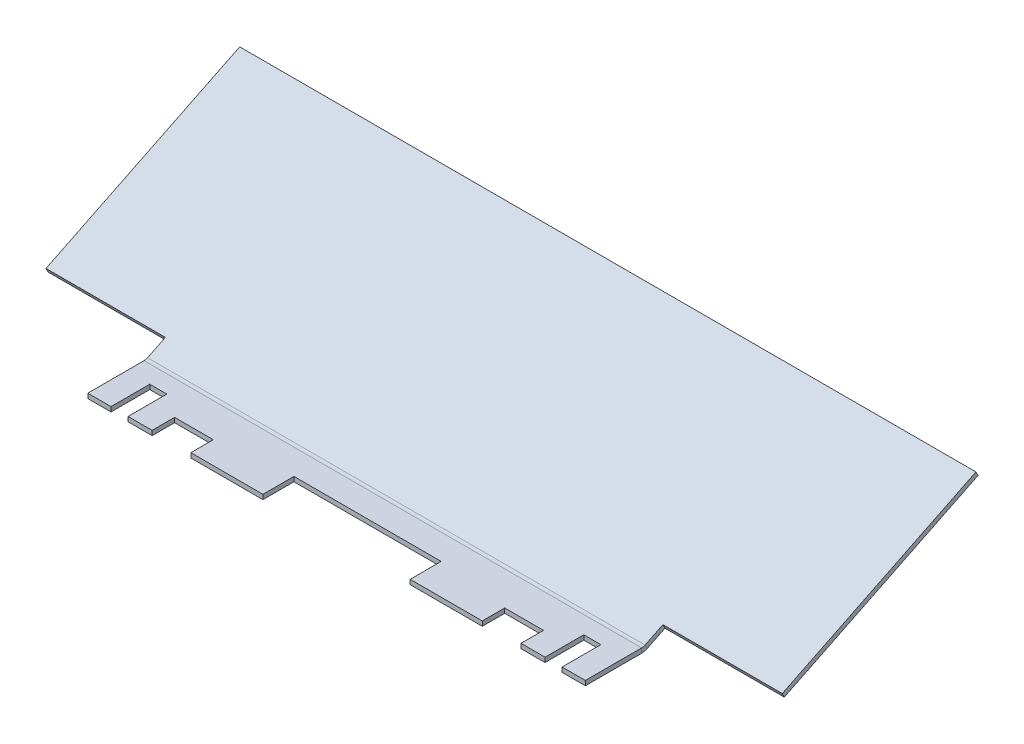
ISO-10303-21;
HEADER;
FILE_DESCRIPTION(('STEP AP214'),'2;1');
FILE_NAME('part.step','',(''),(''),'','','');
FILE_SCHEMA(('AUTOMOTIVE_DESIGN { 1 0 10303 214 1 1 1 1 }'));
ENDSEC;
DATA;
#1=APPLICATION_CONTEXT('core data for automotive mechanical design processes');
#2=APPLICATION_PROTOCOL_DEFINITION('international standard','automotive_design',2000,#1);
#3=PRODUCT_CONTEXT('',#1,'mechanical');
#4=PRODUCT('Part','Part','',(#3));
#5=PRODUCT_RELATED_PRODUCT_CATEGORY('part','',(#4));
#6=PRODUCT_DEFINITION_FORMATION('','',#4);
#7=PRODUCT_DEFINITION_CONTEXT('part definition',#1,'design');
#8=PRODUCT_DEFINITION('design','',#6,#7);
#9=PRODUCT_DEFINITION_SHAPE('','',#8);
#10=(LENGTH_UNIT() NAMED_UNIT(*) SI_UNIT(.MILLI.,.METRE.));
#11=(NAMED_UNIT(*) PLANE_ANGLE_UNIT() SI_UNIT($,.RADIAN.));
#12=(NAMED_UNIT(*) SI_UNIT($,.STERADIAN.) SOLID_ANGLE_UNIT());
#13=UNCERTAINTY_MEASURE_WITH_UNIT(LENGTH_MEASURE(1.E-05),#10,'distance_accuracy_value','');
#14=(GEOMETRIC_REPRESENTATION_CONTEXT(3) GLOBAL_UNCERTAINTY_ASSIGNED_CONTEXT((#13)) GLOBAL_UNIT_ASSIGNED_CONTEXT((#10,
#11,#12)) REPRESENTATION_CONTEXT('',''));
#15=CARTESIAN_POINT('',(0.,0.,0.));
#16=DIRECTION('',(0.,0.,1.));
#17=DIRECTION('',(1.,0.,0.));
#18=AXIS2_PLACEMENT_3D('',#15,#16,#17);
#19=CARTESIAN_POINT('',(60.325,-0.684022719248069,-9.86079297126724));
#20=DIRECTION('',(0.,0.89766761056177,0.440673190639415));
#21=DIRECTION('',(0.,-0.440673190639415,0.89766761056177));
#22=AXIS2_PLACEMENT_3D('',#19,#20,#21);
#23=PLANE('',#22);
#24=DIRECTION('',(1.,0.,0.));
#25=VECTOR('',#24,1.);
#26=CARTESIAN_POINT('',(60.325,0.881117560286229,-13.0490416888371));
#27=LINE('',#26,#25);
#28=CARTESIAN_POINT('',(40.767,0.881117560286229,-13.0490416888371));
#29=VERTEX_POINT('',#28);
#30=CARTESIAN_POINT('',(60.325,0.881117560286225,-13.0490416888371));
#31=VERTEX_POINT('',#30);
#32=EDGE_CURVE('E253',#29,#31,#27,.T.);
#33=ORIENTED_EDGE('',*,*,#32,.F.);
#34=DIRECTION('',(0.,-0.440673190639415,0.89766761056177));
#35=VECTOR('',#34,1.);
#36=CARTESIAN_POINT('',(40.767,-0.684022719248069,-9.86079297126724));
#37=LINE('',#36,#35);
#38=CARTESIAN_POINT('',(40.767,-0.554060584661525,-10.1255306528324));
#39=VERTEX_POINT('',#38);
#40=EDGE_CURVE('E242',#39,#29,#37,.F.);
#41=ORIENTED_EDGE('',*,*,#40,.F.);
#42=DIRECTION('',(-1.,0.,0.));
#43=VECTOR('',#42,1.);
#44=CARTESIAN_POINT('',(60.325,-0.55406058466152,-10.1255306528324));
#45=LINE('',#44,#43);
#46=CARTESIAN_POINT('',(-40.767,-0.554060584661517,-10.1255306528324));
#47=VERTEX_POINT('',#46);
#48=EDGE_CURVE('E460',#39,#47,#45,.T.);
#49=ORIENTED_EDGE('',*,*,#48,.T.);
#50=DIRECTION('',(0.,-0.440673190639415,0.89766761056177));
#51=VECTOR('',#50,1.);
#52=CARTESIAN_POINT('',(-40.767,-0.55406058466152,-10.1255306528324));
#53=LINE('',#52,#51);
#54=CARTESIAN_POINT('',(-40.767,0.881117560286232,-13.0490416888371));
#55=VERTEX_POINT('',#54);
#56=EDGE_CURVE('E276',#55,#47,#53,.T.);
#57=ORIENTED_EDGE('',*,*,#56,.F.);
#58=DIRECTION('',(1.,0.,0.));
#59=VECTOR('',#58,1.);
#60=CARTESIAN_POINT('',(-60.325,0.881117560286232,-13.0490416888371));
#61=LINE('',#60,#59);
#62=CARTESIAN_POINT('',(-60.325,0.881117560286232,-13.0490416888371));
#63=VERTEX_POINT('',#62);
#64=EDGE_CURVE('E271',#63,#55,#61,.T.);
#65=ORIENTED_EDGE('',*,*,#64,.F.);
#66=DIRECTION('',(0.,0.440673190639415,-0.89766761056177));
#67=VECTOR('',#66,1.);
#68=CARTESIAN_POINT('',(-60.325,-0.684022719248069,-9.86079297126724));
#69=LINE('',#68,#67);
#70=CARTESIAN_POINT('',(-60.325,16.4609772807519,-44.7857929712672));
#71=VERTEX_POINT('',#70);
#72=EDGE_CURVE('E450',#63,#71,#69,.T.);
#73=ORIENTED_EDGE('',*,*,#72,.T.);
#74=DIRECTION('',(-1.,0.,0.));
#75=VECTOR('',#74,1.);
#76=CARTESIAN_POINT('',(60.325,16.4609772807519,-44.7857929712672));
#77=LINE('',#76,#75);
#78=CARTESIAN_POINT('',(60.325,16.4609772807519,-44.7857929712672));
#79=VERTEX_POINT('',#78);
#80=EDGE_CURVE('E11',#79,#71,#77,.T.);
#81=ORIENTED_EDGE('',*,*,#80,.F.);
#82=DIRECTION('',(0.,0.440673190639415,-0.89766761056177));
#83=VECTOR('',#82,1.);
#84=CARTESIAN_POINT('',(60.325,-0.684022719248069,-9.86079297126724));
#85=LINE('',#84,#83);
#86=EDGE_CURVE('E264',#31,#79,#85,.T.);
#87=ORIENTED_EDGE('',*,*,#86,.F.);
#88=EDGE_LOOP('',(#33,#41,#49,#57,#65,#73,#81,#87));
#89=FACE_BOUND('',#88,.T.);
#90=ADVANCED_FACE('F32',(#89),#23,.F.);
#91=CARTESIAN_POINT('',(60.325,0.,-9.525));
#92=DIRECTION('',(0.,0.89766761056177,0.440673190639415));
#93=DIRECTION('',(0.,-0.440673190639415,0.89766761056177));
#94=AXIS2_PLACEMENT_3D('',#91,#92,#93);
#95=PLANE('',#94);
#96=DIRECTION('',(0.,0.440673190639414,-0.89766761056177));
#97=VECTOR('',#96,1.);
#98=CARTESIAN_POINT('',(40.767,0.129962134586545,-9.78973768156518));
#99=LINE('',#98,#97);
#100=CARTESIAN_POINT('',(40.767,0.129962134586546,-9.78973768156518));
#101=VERTEX_POINT('',#100);
#102=CARTESIAN_POINT('',(40.767,1.5651402795343,-12.7132487175699));
#103=VERTEX_POINT('',#102);
#104=EDGE_CURVE('E267',#101,#103,#99,.T.);
#105=ORIENTED_EDGE('',*,*,#104,.T.);
#106=DIRECTION('',(1.,0.,0.));
#107=VECTOR('',#106,1.);
#108=CARTESIAN_POINT('',(60.325,1.56514027953429,-12.7132487175699));
#109=LINE('',#108,#107);
#110=CARTESIAN_POINT('',(60.325,1.56514027953429,-12.7132487175699));
#111=VERTEX_POINT('',#110);
#112=EDGE_CURVE('E254',#103,#111,#109,.T.);
#113=ORIENTED_EDGE('',*,*,#112,.T.);
#114=DIRECTION('',(0.,0.440673190639415,-0.89766761056177));
#115=VECTOR('',#114,1.);
#116=CARTESIAN_POINT('',(60.325,0.,-9.525));
#117=LINE('',#116,#115);
#118=CARTESIAN_POINT('',(60.325,17.145,-44.45));
#119=VERTEX_POINT('',#118);
#120=EDGE_CURVE('E458',#111,#119,#117,.T.);
#121=ORIENTED_EDGE('',*,*,#120,.T.);
#122=DIRECTION('',(-1.,0.,0.));
#123=VECTOR('',#122,1.);
#124=CARTESIAN_POINT('',(60.325,17.145,-44.45));
#125=LINE('',#124,#123);
#126=CARTESIAN_POINT('',(-60.325,17.145,-44.45));
#127=VERTEX_POINT('',#126);
#128=EDGE_CURVE('E40',#119,#127,#125,.T.);
#129=ORIENTED_EDGE('',*,*,#128,.T.);
#130=DIRECTION('',(0.,0.440673190639415,-0.89766761056177));
#131=VECTOR('',#130,1.);
#132=CARTESIAN_POINT('',(-60.325,0.,-9.525));
#133=LINE('',#132,#131);
#134=CARTESIAN_POINT('',(-60.325,1.5651402795343,-12.7132487175699));
#135=VERTEX_POINT('',#134);
#136=EDGE_CURVE('E455',#135,#127,#133,.T.);
#137=ORIENTED_EDGE('',*,*,#136,.F.);
#138=DIRECTION('',(1.,0.,0.));
#139=VECTOR('',#138,1.);
#140=CARTESIAN_POINT('',(60.325,1.5651402795343,-12.7132487175699));
#141=LINE('',#140,#139);
#142=CARTESIAN_POINT('',(-40.767,1.5651402795343,-12.7132487175699));
#143=VERTEX_POINT('',#142);
#144=EDGE_CURVE('E272',#135,#143,#141,.T.);
#145=ORIENTED_EDGE('',*,*,#144,.T.);
#146=DIRECTION('',(0.,-0.440673190639415,0.89766761056177));
#147=VECTOR('',#146,1.);
#148=CARTESIAN_POINT('',(-40.767,0.,-9.525));
#149=LINE('',#148,#147);
#150=CARTESIAN_POINT('',(-40.767,0.12996213458655,-9.78973768156519));
#151=VERTEX_POINT('',#150);
#152=EDGE_CURVE('E275',#143,#151,#149,.T.);
#153=ORIENTED_EDGE('',*,*,#152,.T.);
#154=DIRECTION('',(-1.,0.,0.));
#155=VECTOR('',#154,1.);
#156=CARTESIAN_POINT('',(60.325,0.129962134586549,-9.78973768156519));
#157=LINE('',#156,#155);
#158=EDGE_CURVE('E487',#101,#151,#157,.T.);
#159=ORIENTED_EDGE('',*,*,#158,.F.);
#160=EDGE_LOOP('',(#105,#113,#121,#129,#137,#145,#153,#159));
#161=FACE_BOUND('',#160,.T.);
#162=ADVANCED_FACE('F494',(#161),#95,.T.);
#163=CARTESIAN_POINT('',(60.325,-0.762000000000001,-9.23008272945312));
#164=DIRECTION('',(1.,0.,0.));
#165=DIRECTION('',(0.,0.,-1.));
#166=AXIS2_PLACEMENT_3D('',#163,#164,#165);
#167=PLANE('',#166);
#168=ORIENTED_EDGE('',*,*,#120,.F.);
#169=DIRECTION('',(0.,0.89766761056177,0.440673190639415));
#170=VECTOR('',#169,1.);
#171=CARTESIAN_POINT('',(60.325,1.56514027953429,-12.7132487175699));
#172=LINE('',#171,#170);
#173=EDGE_CURVE('E260',#111,#31,#172,.F.);
#174=ORIENTED_EDGE('',*,*,#173,.T.);
#175=ORIENTED_EDGE('',*,*,#86,.T.);
#176=DIRECTION('',(0.,-0.897667610561771,-0.440673190639413));
#177=VECTOR('',#176,1.);
#178=CARTESIAN_POINT('',(60.325,17.145,-44.45));
#179=LINE('',#178,#177);
#180=EDGE_CURVE('E454',#119,#79,#179,.T.);
#181=ORIENTED_EDGE('',*,*,#180,.F.);
#182=EDGE_LOOP('',(#168,#174,#175,#181));
#183=FACE_BOUND('',#182,.T.);
#184=ADVANCED_FACE('F34',(#183),#167,.T.);
#185=CARTESIAN_POINT('',(-60.325,1.27,-9.23008272945314));
#186=DIRECTION('',(-1.,0.,0.));
#187=DIRECTION('',(0.,0.,1.));
#188=AXIS2_PLACEMENT_3D('',#185,#186,#187);
#189=PLANE('',#188);
#190=ORIENTED_EDGE('',*,*,#72,.F.);
#191=DIRECTION('',(0.,-0.89766761056177,-0.440673190639415));
#192=VECTOR('',#191,1.);
#193=CARTESIAN_POINT('',(-60.325,0.881117560286232,-13.0490416888371));
#194=LINE('',#193,#192);
#195=EDGE_CURVE('E282',#63,#135,#194,.F.);
#196=ORIENTED_EDGE('',*,*,#195,.T.);
#197=ORIENTED_EDGE('',*,*,#136,.T.);
#198=DIRECTION('',(0.,-0.897667610561771,-0.440673190639413));
#199=VECTOR('',#198,1.);
#200=CARTESIAN_POINT('',(-60.325,17.145,-44.45));
#201=LINE('',#200,#199);
#202=EDGE_CURVE('E462',#127,#71,#201,.T.);
#203=ORIENTED_EDGE('',*,*,#202,.T.);
#204=EDGE_LOOP('',(#190,#196,#197,#203));
#205=FACE_BOUND('',#204,.T.);
#206=ADVANCED_FACE('F501',(#205),#189,.T.);
#207=CARTESIAN_POINT('',(60.325,-0.762,0.));
#208=DIRECTION('',(0.,0.,1.));
#209=DIRECTION('',(1.,0.,0.));
#210=AXIS2_PLACEMENT_3D('',#207,#208,#209);
#211=PLANE('',#210);
#212=DIRECTION('',(0.,1.,0.));
#213=VECTOR('',#212,1.);
#214=CARTESIAN_POINT('',(-23.876,-0.762000000000001,0.));
#215=LINE('',#214,#213);
#216=CARTESIAN_POINT('',(-23.876,-0.762000000000001,0.));
#217=VERTEX_POINT('',#216);
#218=CARTESIAN_POINT('',(-23.876,0.,0.));
#219=VERTEX_POINT('',#218);
#220=EDGE_CURVE('E307',#217,#219,#215,.T.);
#221=ORIENTED_EDGE('',*,*,#220,.F.);
#222=DIRECTION('',(-1.,0.,0.));
#223=VECTOR('',#222,1.);
#224=CARTESIAN_POINT('',(60.325,-0.762,0.));
#225=LINE('',#224,#223);
#226=CARTESIAN_POINT('',(-12.065,-0.762000000000001,0.));
#227=VERTEX_POINT('',#226);
#228=EDGE_CURVE('E477',#227,#217,#225,.T.);
#229=ORIENTED_EDGE('',*,*,#228,.F.);
#230=DIRECTION('',(0.,1.,0.));
#231=VECTOR('',#230,1.);
#232=CARTESIAN_POINT('',(-12.065,-0.762000000000001,0.));
#233=LINE('',#232,#231);
#234=CARTESIAN_POINT('',(-12.065,0.,0.));
#235=VERTEX_POINT('',#234);
#236=EDGE_CURVE('E398',#227,#235,#233,.T.);
#237=ORIENTED_EDGE('',*,*,#236,.T.);
#238=DIRECTION('',(-1.,0.,0.));
#239=VECTOR('',#238,1.);
#240=CARTESIAN_POINT('',(60.325,0.,0.));
#241=LINE('',#240,#239);
#242=EDGE_CURVE('E484',#235,#219,#241,.T.);
#243=ORIENTED_EDGE('',*,*,#242,.T.);
#244=EDGE_LOOP('',(#221,#229,#237,#243));
#245=FACE_BOUND('',#244,.T.);
#246=ADVANCED_FACE('F607',(#245),#211,.T.);
#247=DIRECTION('',(0.,1.,0.));
#248=VECTOR('',#247,1.);
#249=CARTESIAN_POINT('',(23.876,-0.762000000000001,0.));
#250=LINE('',#249,#248);
#251=CARTESIAN_POINT('',(23.876,-0.762000000000001,0.));
#252=VERTEX_POINT('',#251);
#253=CARTESIAN_POINT('',(23.876,0.,0.));
#254=VERTEX_POINT('',#253);
#255=EDGE_CURVE('E319',#252,#254,#250,.T.);
#256=ORIENTED_EDGE('',*,*,#255,.T.);
#257=CARTESIAN_POINT('',(12.065,0.,0.));
#258=VERTEX_POINT('',#257);
#259=EDGE_CURVE('E533',#254,#258,#241,.T.);
#260=ORIENTED_EDGE('',*,*,#259,.T.);
#261=DIRECTION('',(0.,1.,0.));
#262=VECTOR('',#261,1.);
#263=CARTESIAN_POINT('',(12.065,-0.762000000000001,0.));
#264=LINE('',#263,#262);
#265=CARTESIAN_POINT('',(12.065,-0.762000000000001,0.));
#266=VERTEX_POINT('',#265);
#267=EDGE_CURVE('E410',#266,#258,#264,.T.);
#268=ORIENTED_EDGE('',*,*,#267,.F.);
#269=EDGE_CURVE('E558',#252,#266,#225,.T.);
#270=ORIENTED_EDGE('',*,*,#269,.F.);
#271=EDGE_LOOP('',(#256,#260,#268,#270));
#272=FACE_BOUND('',#271,.T.);
#273=ADVANCED_FACE('F542',(#272),#211,.T.);
#274=DIRECTION('',(0.,1.,0.));
#275=VECTOR('',#274,1.);
#276=CARTESIAN_POINT('',(36.957,-0.762,0.));
#277=LINE('',#276,#275);
#278=CARTESIAN_POINT('',(36.957,-0.762,0.));
#279=VERTEX_POINT('',#278);
#280=CARTESIAN_POINT('',(36.957,0.,0.));
#281=VERTEX_POINT('',#280);
#282=EDGE_CURVE('E355',#279,#281,#277,.T.);
#283=ORIENTED_EDGE('',*,*,#282,.F.);
#284=CARTESIAN_POINT('',(40.767,-0.762,0.));
#285=VERTEX_POINT('',#284);
#286=EDGE_CURVE('E471',#285,#279,#225,.T.);
#287=ORIENTED_EDGE('',*,*,#286,.F.);
#288=DIRECTION('',(0.,-1.,0.));
#289=VECTOR('',#288,1.);
#290=CARTESIAN_POINT('',(40.767,-0.762,0.));
#291=LINE('',#290,#289);
#292=CARTESIAN_POINT('',(40.767,0.,0.));
#293=VERTEX_POINT('',#292);
#294=EDGE_CURVE('E447',#285,#293,#291,.F.);
#295=ORIENTED_EDGE('',*,*,#294,.T.);
#296=EDGE_CURVE('E478',#293,#281,#241,.T.);
#297=ORIENTED_EDGE('',*,*,#296,.T.);
#298=EDGE_LOOP('',(#283,#287,#295,#297));
#299=FACE_BOUND('',#298,.T.);
#300=ADVANCED_FACE('F644',(#299),#211,.T.);
#301=DIRECTION('',(0.,1.,0.));
#302=VECTOR('',#301,1.);
#303=CARTESIAN_POINT('',(-36.957,-0.762,0.));
#304=LINE('',#303,#302);
#305=CARTESIAN_POINT('',(-36.957,-0.762,0.));
#306=VERTEX_POINT('',#305);
#307=CARTESIAN_POINT('',(-36.957,0.,0.));
#308=VERTEX_POINT('',#307);
#309=EDGE_CURVE('E371',#306,#308,#304,.T.);
#310=ORIENTED_EDGE('',*,*,#309,.T.);
#311=CARTESIAN_POINT('',(-40.767,0.,0.));
#312=VERTEX_POINT('',#311);
#313=EDGE_CURVE('E474',#308,#312,#241,.T.);
#314=ORIENTED_EDGE('',*,*,#313,.T.);
#315=DIRECTION('',(0.,1.,0.));
#316=VECTOR('',#315,1.);
#317=CARTESIAN_POINT('',(-40.767,0.,0.));
#318=LINE('',#317,#316);
#319=CARTESIAN_POINT('',(-40.767,-0.762,0.));
#320=VERTEX_POINT('',#319);
#321=EDGE_CURVE('E427',#312,#320,#318,.F.);
#322=ORIENTED_EDGE('',*,*,#321,.T.);
#323=EDGE_CURVE('E470',#306,#320,#225,.T.);
#324=ORIENTED_EDGE('',*,*,#323,.F.);
#325=EDGE_LOOP('',(#310,#314,#322,#324));
#326=FACE_BOUND('',#325,.T.);
#327=ADVANCED_FACE('F529',(#326),#211,.T.);
#328=DIRECTION('',(0.,1.,0.));
#329=VECTOR('',#328,1.);
#330=CARTESIAN_POINT('',(-30.226,-0.762000000000001,0.));
#331=LINE('',#330,#329);
#332=CARTESIAN_POINT('',(-30.226,-0.762,0.));
#333=VERTEX_POINT('',#332);
#334=CARTESIAN_POINT('',(-30.226,0.,0.));
#335=VERTEX_POINT('',#334);
#336=EDGE_CURVE('E47',#333,#335,#331,.T.);
#337=ORIENTED_EDGE('',*,*,#336,.T.);
#338=CARTESIAN_POINT('',(-34.163,0.,0.));
#339=VERTEX_POINT('',#338);
#340=EDGE_CURVE('E483',#335,#339,#241,.T.);
#341=ORIENTED_EDGE('',*,*,#340,.T.);
#342=DIRECTION('',(0.,1.,0.));
#343=VECTOR('',#342,1.);
#344=CARTESIAN_POINT('',(-34.163,-0.762,0.));
#345=LINE('',#344,#343);
#346=CARTESIAN_POINT('',(-34.163,-0.762,0.));
#347=VERTEX_POINT('',#346);
#348=EDGE_CURVE('E383',#347,#339,#345,.T.);
#349=ORIENTED_EDGE('',*,*,#348,.F.);
#350=EDGE_CURVE('E476',#333,#347,#225,.T.);
#351=ORIENTED_EDGE('',*,*,#350,.F.);
#352=EDGE_LOOP('',(#337,#341,#349,#351));
#353=FACE_BOUND('',#352,.T.);
#354=ADVANCED_FACE('F569',(#353),#211,.T.);
#355=CARTESIAN_POINT('',(60.325,1.27,-9.23008272945314));
#356=DIRECTION('',(-1.,0.,0.));
#357=DIRECTION('',(0.,0.,1.));
#358=AXIS2_PLACEMENT_3D('',#355,#356,#357);
#359=CYLINDRICAL_SURFACE('',#358,1.27);
#360=ORIENTED_EDGE('',*,*,#158,.T.);
#361=CARTESIAN_POINT('',(-40.767,1.27,-9.23008272945314));
#362=DIRECTION('',(1.,0.,0.));
#363=DIRECTION('',(0.,0.,-1.));
#364=AXIS2_PLACEMENT_3D('',#361,#362,#363);
#365=CIRCLE('',#364,1.27);
#366=CARTESIAN_POINT('',(-40.767,0.,-9.23008272945313));
#367=VERTEX_POINT('',#366);
#368=EDGE_CURVE('E407',#367,#151,#365,.T.);
#369=ORIENTED_EDGE('',*,*,#368,.F.);
#370=DIRECTION('',(-1.,0.,0.));
#371=VECTOR('',#370,1.);
#372=CARTESIAN_POINT('',(60.325,0.,-9.23008272945313));
#373=LINE('',#372,#371);
#374=CARTESIAN_POINT('',(40.767,0.,-9.23008272945313));
#375=VERTEX_POINT('',#374);
#376=EDGE_CURVE('E481',#375,#367,#373,.T.);
#377=ORIENTED_EDGE('',*,*,#376,.F.);
#378=CARTESIAN_POINT('',(40.767,1.27,-9.23008272945314));
#379=DIRECTION('',(-1.,0.,0.));
#380=DIRECTION('',(0.,0.,1.));
#381=AXIS2_PLACEMENT_3D('',#378,#379,#380);
#382=CIRCLE('',#381,1.27);
#383=EDGE_CURVE('E432',#101,#375,#382,.T.);
#384=ORIENTED_EDGE('',*,*,#383,.F.);
#385=EDGE_LOOP('',(#360,#369,#377,#384));
#386=FACE_BOUND('',#385,.T.);
#387=ADVANCED_FACE('F598',(#386),#359,.F.);
#388=CARTESIAN_POINT('',(60.325,0.,0.));
#389=DIRECTION('',(0.,1.,0.));
#390=DIRECTION('',(0.,0.,1.));
#391=AXIS2_PLACEMENT_3D('',#388,#389,#390);
#392=PLANE('',#391);
#393=DIRECTION('',(0.,0.,-1.));
#394=VECTOR('',#393,1.);
#395=CARTESIAN_POINT('',(-23.876,0.,-3.68300000000006));
#396=LINE('',#395,#394);
#397=CARTESIAN_POINT('',(-23.876,0.,-3.68300000000006));
#398=VERTEX_POINT('',#397);
#399=EDGE_CURVE('E292',#219,#398,#396,.T.);
#400=ORIENTED_EDGE('',*,*,#399,.F.);
#401=ORIENTED_EDGE('',*,*,#242,.F.);
#402=DIRECTION('',(0.,0.,1.));
#403=VECTOR('',#402,1.);
#404=CARTESIAN_POINT('',(-12.065,0.,-5.07999999999999));
#405=LINE('',#404,#403);
#406=CARTESIAN_POINT('',(-12.065,0.,-5.07999999999999));
#407=VERTEX_POINT('',#406);
#408=EDGE_CURVE('E380',#407,#235,#405,.T.);
#409=ORIENTED_EDGE('',*,*,#408,.F.);
#410=DIRECTION('',(-1.,0.,0.));
#411=VECTOR('',#410,1.);
#412=CARTESIAN_POINT('',(-12.065,0.,-5.07999999999999));
#413=LINE('',#412,#411);
#414=CARTESIAN_POINT('',(12.065,0.,-5.07999999999999));
#415=VERTEX_POINT('',#414);
#416=EDGE_CURVE('E392',#415,#407,#413,.T.);
#417=ORIENTED_EDGE('',*,*,#416,.F.);
#418=DIRECTION('',(0.,0.,-1.));
#419=VECTOR('',#418,1.);
#420=CARTESIAN_POINT('',(12.065,0.,-5.07999999999999));
#421=LINE('',#420,#419);
#422=EDGE_CURVE('E400',#258,#415,#421,.T.);
#423=ORIENTED_EDGE('',*,*,#422,.F.);
#424=ORIENTED_EDGE('',*,*,#259,.F.);
#425=DIRECTION('',(0.,0.,1.));
#426=VECTOR('',#425,1.);
#427=CARTESIAN_POINT('',(23.876,0.,-3.68299999999999));
#428=LINE('',#427,#426);
#429=CARTESIAN_POINT('',(23.876,0.,-3.68299999999999));
#430=VERTEX_POINT('',#429);
#431=EDGE_CURVE('E306',#430,#254,#428,.T.);
#432=ORIENTED_EDGE('',*,*,#431,.F.);
#433=DIRECTION('',(-1.,0.,0.));
#434=VECTOR('',#433,1.);
#435=CARTESIAN_POINT('',(23.876,0.,-3.68299999999999));
#436=LINE('',#435,#434);
#437=CARTESIAN_POINT('',(30.226,0.,-3.68299999999999));
#438=VERTEX_POINT('',#437);
#439=EDGE_CURVE('E315',#438,#430,#436,.T.);
#440=ORIENTED_EDGE('',*,*,#439,.F.);
#441=DIRECTION('',(0.,0.,-1.));
#442=VECTOR('',#441,1.);
#443=CARTESIAN_POINT('',(30.226,0.,-3.68299999999999));
#444=LINE('',#443,#442);
#445=CARTESIAN_POINT('',(30.226,0.,0.));
#446=VERTEX_POINT('',#445);
#447=EDGE_CURVE('E321',#446,#438,#444,.T.);
#448=ORIENTED_EDGE('',*,*,#447,.F.);
#449=CARTESIAN_POINT('',(34.163,0.,0.));
#450=VERTEX_POINT('',#449);
#451=EDGE_CURVE('E482',#450,#446,#241,.T.);
#452=ORIENTED_EDGE('',*,*,#451,.F.);
#453=DIRECTION('',(0.,0.,1.));
#454=VECTOR('',#453,1.);
#455=CARTESIAN_POINT('',(34.163,0.,-6.34999999999998));
#456=LINE('',#455,#454);
#457=CARTESIAN_POINT('',(34.163,0.,-6.34999999999998));
#458=VERTEX_POINT('',#457);
#459=EDGE_CURVE('E348',#458,#450,#456,.T.);
#460=ORIENTED_EDGE('',*,*,#459,.F.);
#461=DIRECTION('',(-1.,0.,0.));
#462=VECTOR('',#461,1.);
#463=CARTESIAN_POINT('',(36.957,0.,-6.34999999999997));
#464=LINE('',#463,#462);
#465=CARTESIAN_POINT('',(36.957,0.,-6.34999999999997));
#466=VERTEX_POINT('',#465);
#467=EDGE_CURVE('E328',#466,#458,#464,.T.);
#468=ORIENTED_EDGE('',*,*,#467,.F.);
#469=DIRECTION('',(0.,0.,-1.));
#470=VECTOR('',#469,1.);
#471=CARTESIAN_POINT('',(36.957,0.,-6.34999999999997));
#472=LINE('',#471,#470);
#473=EDGE_CURVE('E339',#281,#466,#472,.T.);
#474=ORIENTED_EDGE('',*,*,#473,.F.);
#475=ORIENTED_EDGE('',*,*,#296,.F.);
#476=DIRECTION('',(0.,0.,1.));
#477=VECTOR('',#476,1.);
#478=CARTESIAN_POINT('',(40.767,0.,0.));
#479=LINE('',#478,#477);
#480=EDGE_CURVE('E441',#293,#375,#479,.F.);
#481=ORIENTED_EDGE('',*,*,#480,.T.);
#482=ORIENTED_EDGE('',*,*,#376,.T.);
#483=DIRECTION('',(0.,0.,-1.));
#484=VECTOR('',#483,1.);
#485=CARTESIAN_POINT('',(-40.767,0.,0.));
#486=LINE('',#485,#484);
#487=EDGE_CURVE('E423',#312,#367,#486,.T.);
#488=ORIENTED_EDGE('',*,*,#487,.F.);
#489=ORIENTED_EDGE('',*,*,#313,.F.);
#490=DIRECTION('',(0.,0.,1.));
#491=VECTOR('',#490,1.);
#492=CARTESIAN_POINT('',(-36.957,0.,-6.35000000000008));
#493=LINE('',#492,#491);
#494=CARTESIAN_POINT('',(-36.957,0.,-6.35000000000008));
#495=VERTEX_POINT('',#494);
#496=EDGE_CURVE('E354',#495,#308,#493,.T.);
#497=ORIENTED_EDGE('',*,*,#496,.F.);
#498=DIRECTION('',(-1.,0.,0.));
#499=VECTOR('',#498,1.);
#500=CARTESIAN_POINT('',(-36.957,0.,-6.35000000000008));
#501=LINE('',#500,#499);
#502=CARTESIAN_POINT('',(-34.163,0.,-6.35000000000008));
#503=VERTEX_POINT('',#502);
#504=EDGE_CURVE('E365',#503,#495,#501,.T.);
#505=ORIENTED_EDGE('',*,*,#504,.F.);
#506=DIRECTION('',(0.,0.,-1.));
#507=VECTOR('',#506,1.);
#508=CARTESIAN_POINT('',(-34.163,0.,-6.35000000000008));
#509=LINE('',#508,#507);
#510=EDGE_CURVE('E373',#339,#503,#509,.T.);
#511=ORIENTED_EDGE('',*,*,#510,.F.);
#512=ORIENTED_EDGE('',*,*,#340,.F.);
#513=DIRECTION('',(0.,0.,1.));
#514=VECTOR('',#513,1.);
#515=CARTESIAN_POINT('',(-30.226,0.,-3.68300000000008));
#516=LINE('',#515,#514);
#517=CARTESIAN_POINT('',(-30.226,0.,-3.68300000000008));
#518=VERTEX_POINT('',#517);
#519=EDGE_CURVE('E300',#518,#335,#516,.T.);
#520=ORIENTED_EDGE('',*,*,#519,.F.);
#521=DIRECTION('',(-1.,0.,0.));
#522=VECTOR('',#521,1.);
#523=CARTESIAN_POINT('',(-23.876,0.,-3.68300000000006));
#524=LINE('',#523,#522);
#525=EDGE_CURVE('E285',#398,#518,#524,.T.);
#526=ORIENTED_EDGE('',*,*,#525,.F.);
#527=EDGE_LOOP('',(#400,#401,#409,#417,#423,#424,#432,#440,#448,#452,#460,#468,#474,#475,#481,
#482,#488,#489,#497,#505,#511,#512,#520,#526));
#528=FACE_BOUND('',#527,.T.);
#529=ADVANCED_FACE('F552',(#528),#392,.T.);
#530=DIRECTION('',(0.,1.,0.));
#531=VECTOR('',#530,1.);
#532=CARTESIAN_POINT('',(30.226,-0.762000000000001,0.));
#533=LINE('',#532,#531);
#534=CARTESIAN_POINT('',(30.226,-0.762000000000001,0.));
#535=VERTEX_POINT('',#534);
#536=EDGE_CURVE('E331',#535,#446,#533,.T.);
#537=ORIENTED_EDGE('',*,*,#536,.F.);
#538=CARTESIAN_POINT('',(34.163,-0.762,0.));
#539=VERTEX_POINT('',#538);
#540=EDGE_CURVE('E475',#539,#535,#225,.T.);
#541=ORIENTED_EDGE('',*,*,#540,.F.);
#542=DIRECTION('',(0.,1.,0.));
#543=VECTOR('',#542,1.);
#544=CARTESIAN_POINT('',(34.163,-0.762,0.));
#545=LINE('',#544,#543);
#546=EDGE_CURVE('E357',#539,#450,#545,.T.);
#547=ORIENTED_EDGE('',*,*,#546,.T.);
#548=ORIENTED_EDGE('',*,*,#451,.T.);
#549=EDGE_LOOP('',(#537,#541,#547,#548));
#550=FACE_BOUND('',#549,.T.);
#551=ADVANCED_FACE('F604',(#550),#211,.T.);
#552=CARTESIAN_POINT('',(60.325,-0.762,0.));
#553=DIRECTION('',(0.,1.,0.));
#554=DIRECTION('',(0.,0.,1.));
#555=AXIS2_PLACEMENT_3D('',#552,#553,#554);
#556=PLANE('',#555);
#557=ORIENTED_EDGE('',*,*,#228,.T.);
#558=DIRECTION('',(0.,0.,-1.));
#559=VECTOR('',#558,1.);
#560=CARTESIAN_POINT('',(-23.876,-0.762000000000001,-3.68300000000006));
#561=LINE('',#560,#559);
#562=CARTESIAN_POINT('',(-23.876,-0.762000000000001,-3.68300000000006));
#563=VERTEX_POINT('',#562);
#564=EDGE_CURVE('E294',#217,#563,#561,.T.);
#565=ORIENTED_EDGE('',*,*,#564,.T.);
#566=DIRECTION('',(-1.,0.,0.));
#567=VECTOR('',#566,1.);
#568=CARTESIAN_POINT('',(-23.876,-0.762000000000001,-3.68300000000006));
#569=LINE('',#568,#567);
#570=CARTESIAN_POINT('',(-30.226,-0.762000000000001,-3.68300000000008));
#571=VERTEX_POINT('',#570);
#572=EDGE_CURVE('E288',#563,#571,#569,.T.);
#573=ORIENTED_EDGE('',*,*,#572,.T.);
#574=DIRECTION('',(0.,0.,1.));
#575=VECTOR('',#574,1.);
#576=CARTESIAN_POINT('',(-30.226,-0.762000000000001,-3.68300000000008));
#577=LINE('',#576,#575);
#578=EDGE_CURVE('E291',#571,#333,#577,.T.);
#579=ORIENTED_EDGE('',*,*,#578,.T.);
#580=ORIENTED_EDGE('',*,*,#350,.T.);
#581=DIRECTION('',(0.,0.,-1.));
#582=VECTOR('',#581,1.);
#583=CARTESIAN_POINT('',(-34.163,-0.762,-6.35000000000008));
#584=LINE('',#583,#582);
#585=CARTESIAN_POINT('',(-34.163,-0.762,-6.35000000000008));
#586=VERTEX_POINT('',#585);
#587=EDGE_CURVE('E364',#347,#586,#584,.T.);
#588=ORIENTED_EDGE('',*,*,#587,.T.);
#589=DIRECTION('',(-1.,0.,0.));
#590=VECTOR('',#589,1.);
#591=CARTESIAN_POINT('',(-36.957,-0.762,-6.35000000000008));
#592=LINE('',#591,#590);
#593=CARTESIAN_POINT('',(-36.957,-0.762,-6.35000000000008));
#594=VERTEX_POINT('',#593);
#595=EDGE_CURVE('E368',#586,#594,#592,.T.);
#596=ORIENTED_EDGE('',*,*,#595,.T.);
#597=DIRECTION('',(0.,0.,1.));
#598=VECTOR('',#597,1.);
#599=CARTESIAN_POINT('',(-36.957,-0.762,-6.35000000000008));
#600=LINE('',#599,#598);
#601=EDGE_CURVE('E361',#594,#306,#600,.T.);
#602=ORIENTED_EDGE('',*,*,#601,.T.);
#603=ORIENTED_EDGE('',*,*,#323,.T.);
#604=DIRECTION('',(0.,0.,1.));
#605=VECTOR('',#604,1.);
#606=CARTESIAN_POINT('',(-40.767,-0.762,0.));
#607=LINE('',#606,#605);
#608=CARTESIAN_POINT('',(-40.767,-0.762000000000001,-9.23008272945312));
#609=VERTEX_POINT('',#608);
#610=EDGE_CURVE('E424',#320,#609,#607,.F.);
#611=ORIENTED_EDGE('',*,*,#610,.T.);
#612=DIRECTION('',(-1.,0.,0.));
#613=VECTOR('',#612,1.);
#614=CARTESIAN_POINT('',(60.325,-0.762000000000001,-9.23008272945312));
#615=LINE('',#614,#613);
#616=CARTESIAN_POINT('',(40.767,-0.762000000000001,-9.23008272945312));
#617=VERTEX_POINT('',#616);
#618=EDGE_CURVE('E467',#617,#609,#615,.T.);
#619=ORIENTED_EDGE('',*,*,#618,.F.);
#620=DIRECTION('',(0.,0.,-1.));
#621=VECTOR('',#620,1.);
#622=CARTESIAN_POINT('',(40.767,-0.762,0.));
#623=LINE('',#622,#621);
#624=EDGE_CURVE('E440',#285,#617,#623,.T.);
#625=ORIENTED_EDGE('',*,*,#624,.F.);
#626=ORIENTED_EDGE('',*,*,#286,.T.);
#627=DIRECTION('',(0.,0.,-1.));
#628=VECTOR('',#627,1.);
#629=CARTESIAN_POINT('',(36.957,-0.762,-6.34999999999997));
#630=LINE('',#629,#628);
#631=CARTESIAN_POINT('',(36.957,-0.762,-6.34999999999997));
#632=VERTEX_POINT('',#631);
#633=EDGE_CURVE('E342',#279,#632,#630,.T.);
#634=ORIENTED_EDGE('',*,*,#633,.T.);
#635=DIRECTION('',(-1.,0.,0.));
#636=VECTOR('',#635,1.);
#637=CARTESIAN_POINT('',(36.957,-0.762,-6.34999999999997));
#638=LINE('',#637,#636);
#639=CARTESIAN_POINT('',(34.163,-0.762,-6.34999999999998));
#640=VERTEX_POINT('',#639);
#641=EDGE_CURVE('E335',#632,#640,#638,.T.);
#642=ORIENTED_EDGE('',*,*,#641,.T.);
#643=DIRECTION('',(0.,0.,1.));
#644=VECTOR('',#643,1.);
#645=CARTESIAN_POINT('',(34.163,-0.762,-6.34999999999998));
#646=LINE('',#645,#644);
#647=EDGE_CURVE('E338',#640,#539,#646,.T.);
#648=ORIENTED_EDGE('',*,*,#647,.T.);
#649=ORIENTED_EDGE('',*,*,#540,.T.);
#650=DIRECTION('',(0.,0.,-1.));
#651=VECTOR('',#650,1.);
#652=CARTESIAN_POINT('',(30.226,-0.762000000000001,-3.68299999999999));
#653=LINE('',#652,#651);
#654=CARTESIAN_POINT('',(30.226,-0.762,-3.68299999999999));
#655=VERTEX_POINT('',#654);
#656=EDGE_CURVE('E314',#535,#655,#653,.T.);
#657=ORIENTED_EDGE('',*,*,#656,.T.);
#658=DIRECTION('',(-1.,0.,0.));
#659=VECTOR('',#658,1.);
#660=CARTESIAN_POINT('',(23.876,-0.762000000000001,-3.68299999999999));
#661=LINE('',#660,#659);
#662=CARTESIAN_POINT('',(23.876,-0.762000000000001,-3.68299999999999));
#663=VERTEX_POINT('',#662);
#664=EDGE_CURVE('E55',#655,#663,#661,.T.);
#665=ORIENTED_EDGE('',*,*,#664,.T.);
#666=DIRECTION('',(0.,0.,1.));
#667=VECTOR('',#666,1.);
#668=CARTESIAN_POINT('',(23.876,-0.762000000000001,-3.68299999999999));
#669=LINE('',#668,#667);
#670=EDGE_CURVE('E311',#663,#252,#669,.T.);
#671=ORIENTED_EDGE('',*,*,#670,.T.);
#672=ORIENTED_EDGE('',*,*,#269,.T.);
#673=DIRECTION('',(0.,0.,-1.));
#674=VECTOR('',#673,1.);
#675=CARTESIAN_POINT('',(12.065,-0.762000000000001,-5.07999999999999));
#676=LINE('',#675,#674);
#677=CARTESIAN_POINT('',(12.065,-0.762,-5.07999999999999));
#678=VERTEX_POINT('',#677);
#679=EDGE_CURVE('E391',#266,#678,#676,.T.);
#680=ORIENTED_EDGE('',*,*,#679,.T.);
#681=DIRECTION('',(-1.,0.,0.));
#682=VECTOR('',#681,1.);
#683=CARTESIAN_POINT('',(-12.065,-0.762000000000001,-5.07999999999999));
#684=LINE('',#683,#682);
#685=CARTESIAN_POINT('',(-12.065,-0.762000000000001,-5.07999999999999));
#686=VERTEX_POINT('',#685);
#687=EDGE_CURVE('E395',#678,#686,#684,.T.);
#688=ORIENTED_EDGE('',*,*,#687,.T.);
#689=DIRECTION('',(0.,0.,1.));
#690=VECTOR('',#689,1.);
#691=CARTESIAN_POINT('',(-12.065,-0.762000000000001,-5.07999999999999));
#692=LINE('',#691,#690);
#693=EDGE_CURVE('E388',#686,#227,#692,.T.);
#694=ORIENTED_EDGE('',*,*,#693,.T.);
#695=EDGE_LOOP('',(#557,#565,#573,#579,#580,#588,#596,#602,#603,#611,#619,#625,#626,#634,#642,
#648,#649,#657,#665,#671,#672,#680,#688,#694));
#696=FACE_BOUND('',#695,.T.);
#697=ADVANCED_FACE('F520',(#696),#556,.F.);
#698=CARTESIAN_POINT('',(60.325,1.27,-9.23008272945314));
#699=DIRECTION('',(-1.,0.,0.));
#700=DIRECTION('',(0.,0.,1.));
#701=AXIS2_PLACEMENT_3D('',#698,#699,#700);
#702=CYLINDRICAL_SURFACE('',#701,2.032);
#703=CARTESIAN_POINT('',(-40.767,1.27,-9.23008272945314));
#704=DIRECTION('',(-1.,0.,0.));
#705=DIRECTION('',(0.,0.,1.));
#706=AXIS2_PLACEMENT_3D('',#703,#704,#705);
#707=CIRCLE('',#706,2.032);
#708=EDGE_CURVE('E415',#609,#47,#707,.F.);
#709=ORIENTED_EDGE('',*,*,#708,.T.);
#710=ORIENTED_EDGE('',*,*,#48,.F.);
#711=CARTESIAN_POINT('',(40.767,1.27,-9.23008272945314));
#712=DIRECTION('',(-1.,0.,0.));
#713=DIRECTION('',(0.,0.,1.));
#714=AXIS2_PLACEMENT_3D('',#711,#712,#713);
#715=CIRCLE('',#714,2.032);
#716=EDGE_CURVE('E435',#39,#617,#715,.T.);
#717=ORIENTED_EDGE('',*,*,#716,.T.);
#718=ORIENTED_EDGE('',*,*,#618,.T.);
#719=EDGE_LOOP('',(#709,#710,#717,#718));
#720=FACE_BOUND('',#719,.T.);
#721=ADVANCED_FACE('F515',(#720),#702,.T.);
#722=CARTESIAN_POINT('',(60.325,17.145,-44.45));
#723=DIRECTION('',(0.,0.440673190639413,-0.897667610561771));
#724=DIRECTION('',(0.,0.897667610561771,0.440673190639413));
#725=AXIS2_PLACEMENT_3D('',#722,#723,#724);
#726=PLANE('',#725);
#727=ORIENTED_EDGE('',*,*,#202,.F.);
#728=ORIENTED_EDGE('',*,*,#128,.F.);
#729=ORIENTED_EDGE('',*,*,#180,.T.);
#730=ORIENTED_EDGE('',*,*,#80,.T.);
#731=EDGE_LOOP('',(#727,#728,#729,#730));
#732=FACE_BOUND('',#731,.T.);
#733=ADVANCED_FACE('F498',(#732),#726,.T.);
#734=CARTESIAN_POINT('',(40.767,-0.762,0.));
#735=DIRECTION('',(1.,0.,0.));
#736=DIRECTION('',(0.,0.,-1.));
#737=AXIS2_PLACEMENT_3D('',#734,#735,#736);
#738=PLANE('',#737);
#739=ORIENTED_EDGE('',*,*,#294,.F.);
#740=ORIENTED_EDGE('',*,*,#624,.T.);
#741=DIRECTION('',(0.,-1.,0.));
#742=VECTOR('',#741,1.);
#743=CARTESIAN_POINT('',(40.767,-0.762000000000001,-9.23008272945312));
#744=LINE('',#743,#742);
#745=EDGE_CURVE('E444',#617,#375,#744,.F.);
#746=ORIENTED_EDGE('',*,*,#745,.T.);
#747=ORIENTED_EDGE('',*,*,#480,.F.);
#748=EDGE_LOOP('',(#739,#740,#746,#747));
#749=FACE_BOUND('',#748,.T.);
#750=ADVANCED_FACE('F596',(#749),#738,.T.);
#751=CARTESIAN_POINT('',(40.767,1.27,-9.23008272945314));
#752=DIRECTION('',(1.,0.,0.));
#753=DIRECTION('',(0.,0.,-1.));
#754=AXIS2_PLACEMENT_3D('',#751,#752,#753);
#755=PLANE('',#754);
#756=ORIENTED_EDGE('',*,*,#745,.F.);
#757=ORIENTED_EDGE('',*,*,#716,.F.);
#758=DIRECTION('',(0.,0.897667610561774,0.440673190639407));
#759=VECTOR('',#758,1.);
#760=CARTESIAN_POINT('',(40.767,0.129962134586546,-9.78973768156518));
#761=LINE('',#760,#759);
#762=EDGE_CURVE('E248',#101,#39,#761,.F.);
#763=ORIENTED_EDGE('',*,*,#762,.F.);
#764=ORIENTED_EDGE('',*,*,#383,.T.);
#765=EDGE_LOOP('',(#756,#757,#763,#764));
#766=FACE_BOUND('',#765,.T.);
#767=ADVANCED_FACE('F616',(#766),#755,.T.);
#768=CARTESIAN_POINT('',(-40.767,0.,0.));
#769=DIRECTION('',(1.,0.,0.));
#770=DIRECTION('',(0.,0.,-1.));
#771=AXIS2_PLACEMENT_3D('',#768,#769,#770);
#772=PLANE('',#771);
#773=ORIENTED_EDGE('',*,*,#487,.T.);
#774=DIRECTION('',(0.,1.,0.));
#775=VECTOR('',#774,1.);
#776=CARTESIAN_POINT('',(-40.767,0.,-9.23008272945313));
#777=LINE('',#776,#775);
#778=EDGE_CURVE('E429',#367,#609,#777,.F.);
#779=ORIENTED_EDGE('',*,*,#778,.T.);
#780=ORIENTED_EDGE('',*,*,#610,.F.);
#781=ORIENTED_EDGE('',*,*,#321,.F.);
#782=EDGE_LOOP('',(#773,#779,#780,#781));
#783=FACE_BOUND('',#782,.T.);
#784=ADVANCED_FACE('F526',(#783),#772,.F.);
#785=CARTESIAN_POINT('',(-40.767,1.27,-9.23008272945314));
#786=DIRECTION('',(-1.,0.,0.));
#787=DIRECTION('',(0.,0.,1.));
#788=AXIS2_PLACEMENT_3D('',#785,#786,#787);
#789=PLANE('',#788);
#790=ORIENTED_EDGE('',*,*,#708,.F.);
#791=ORIENTED_EDGE('',*,*,#778,.F.);
#792=ORIENTED_EDGE('',*,*,#368,.T.);
#793=DIRECTION('',(0.,0.89766761056177,0.440673190639415));
#794=VECTOR('',#793,1.);
#795=CARTESIAN_POINT('',(-40.767,0.129962134586551,-9.78973768156519));
#796=LINE('',#795,#794);
#797=EDGE_CURVE('E418',#151,#47,#796,.F.);
#798=ORIENTED_EDGE('',*,*,#797,.T.);
#799=EDGE_LOOP('',(#790,#791,#792,#798));
#800=FACE_BOUND('',#799,.T.);
#801=ADVANCED_FACE('F511',(#800),#789,.T.);
#802=CARTESIAN_POINT('',(-12.065,-0.762000000000001,-5.07999999999999));
#803=DIRECTION('',(-1.,0.,0.));
#804=DIRECTION('',(0.,0.,1.));
#805=AXIS2_PLACEMENT_3D('',#802,#803,#804);
#806=PLANE('',#805);
#807=ORIENTED_EDGE('',*,*,#408,.T.);
#808=ORIENTED_EDGE('',*,*,#236,.F.);
#809=ORIENTED_EDGE('',*,*,#693,.F.);
#810=DIRECTION('',(0.,1.,0.));
#811=VECTOR('',#810,1.);
#812=CARTESIAN_POINT('',(-12.065,-0.762000000000001,-5.07999999999999));
#813=LINE('',#812,#811);
#814=EDGE_CURVE('E405',#686,#407,#813,.T.);
#815=ORIENTED_EDGE('',*,*,#814,.T.);
#816=EDGE_LOOP('',(#807,#808,#809,#815));
#817=FACE_BOUND('',#816,.T.);
#818=ADVANCED_FACE('F625',(#817),#806,.F.);
#819=CARTESIAN_POINT('',(-12.065,-0.762000000000001,-5.07999999999999));
#820=DIRECTION('',(0.,0.,-1.));
#821=DIRECTION('',(-1.,0.,0.));
#822=AXIS2_PLACEMENT_3D('',#819,#820,#821);
#823=PLANE('',#822);
#824=ORIENTED_EDGE('',*,*,#416,.T.);
#825=ORIENTED_EDGE('',*,*,#814,.F.);
#826=ORIENTED_EDGE('',*,*,#687,.F.);
#827=DIRECTION('',(0.,1.,0.));
#828=VECTOR('',#827,1.);
#829=CARTESIAN_POINT('',(12.065,-0.762000000000001,-5.07999999999999));
#830=LINE('',#829,#828);
#831=EDGE_CURVE('E408',#678,#415,#830,.T.);
#832=ORIENTED_EDGE('',*,*,#831,.T.);
#833=EDGE_LOOP('',(#824,#825,#826,#832));
#834=FACE_BOUND('',#833,.T.);
#835=ADVANCED_FACE('F556',(#834),#823,.F.);
#836=CARTESIAN_POINT('',(12.065,-0.762000000000001,-5.07999999999999));
#837=DIRECTION('',(1.,0.,0.));
#838=DIRECTION('',(0.,0.,-1.));
#839=AXIS2_PLACEMENT_3D('',#836,#837,#838);
#840=PLANE('',#839);
#841=ORIENTED_EDGE('',*,*,#422,.T.);
#842=ORIENTED_EDGE('',*,*,#831,.F.);
#843=ORIENTED_EDGE('',*,*,#679,.F.);
#844=ORIENTED_EDGE('',*,*,#267,.T.);
#845=EDGE_LOOP('',(#841,#842,#843,#844));
#846=FACE_BOUND('',#845,.T.);
#847=ADVANCED_FACE('F548',(#846),#840,.F.);
#848=CARTESIAN_POINT('',(-36.957,-0.762,-6.35000000000008));
#849=DIRECTION('',(-1.,0.,0.));
#850=DIRECTION('',(0.,0.,1.));
#851=AXIS2_PLACEMENT_3D('',#848,#849,#850);
#852=PLANE('',#851);
#853=ORIENTED_EDGE('',*,*,#496,.T.);
#854=ORIENTED_EDGE('',*,*,#309,.F.);
#855=ORIENTED_EDGE('',*,*,#601,.F.);
#856=DIRECTION('',(0.,1.,0.));
#857=VECTOR('',#856,1.);
#858=CARTESIAN_POINT('',(-36.957,-0.762,-6.35000000000008));
#859=LINE('',#858,#857);
#860=EDGE_CURVE('E378',#594,#495,#859,.T.);
#861=ORIENTED_EDGE('',*,*,#860,.T.);
#862=EDGE_LOOP('',(#853,#854,#855,#861));
#863=FACE_BOUND('',#862,.T.);
#864=ADVANCED_FACE('F578',(#863),#852,.F.);
#865=CARTESIAN_POINT('',(-36.957,-0.762,-6.35000000000008));
#866=DIRECTION('',(0.,0.,-1.));
#867=DIRECTION('',(-1.,0.,0.));
#868=AXIS2_PLACEMENT_3D('',#865,#866,#867);
#869=PLANE('',#868);
#870=ORIENTED_EDGE('',*,*,#504,.T.);
#871=ORIENTED_EDGE('',*,*,#860,.F.);
#872=ORIENTED_EDGE('',*,*,#595,.F.);
#873=DIRECTION('',(0.,1.,0.));
#874=VECTOR('',#873,1.);
#875=CARTESIAN_POINT('',(-34.163,-0.762,-6.35000000000008));
#876=LINE('',#875,#874);
#877=EDGE_CURVE('E381',#586,#503,#876,.T.);
#878=ORIENTED_EDGE('',*,*,#877,.T.);
#879=EDGE_LOOP('',(#870,#871,#872,#878));
#880=FACE_BOUND('',#879,.T.);
#881=ADVANCED_FACE('F575',(#880),#869,.F.);
#882=CARTESIAN_POINT('',(-34.163,-0.762,-6.35000000000008));
#883=DIRECTION('',(1.,0.,0.));
#884=DIRECTION('',(0.,0.,-1.));
#885=AXIS2_PLACEMENT_3D('',#882,#883,#884);
#886=PLANE('',#885);
#887=ORIENTED_EDGE('',*,*,#510,.T.);
#888=ORIENTED_EDGE('',*,*,#877,.F.);
#889=ORIENTED_EDGE('',*,*,#587,.F.);
#890=ORIENTED_EDGE('',*,*,#348,.T.);
#891=EDGE_LOOP('',(#887,#888,#889,#890));
#892=FACE_BOUND('',#891,.T.);
#893=ADVANCED_FACE('F567',(#892),#886,.F.);
#894=CARTESIAN_POINT('',(36.957,-0.762,-6.34999999999997));
#895=DIRECTION('',(0.,0.,-1.));
#896=DIRECTION('',(-1.,0.,0.));
#897=AXIS2_PLACEMENT_3D('',#894,#895,#896);
#898=PLANE('',#897);
#899=ORIENTED_EDGE('',*,*,#467,.T.);
#900=DIRECTION('',(0.,1.,0.));
#901=VECTOR('',#900,1.);
#902=CARTESIAN_POINT('',(34.163,-0.762,-6.34999999999998));
#903=LINE('',#902,#901);
#904=EDGE_CURVE('E345',#640,#458,#903,.T.);
#905=ORIENTED_EDGE('',*,*,#904,.F.);
#906=ORIENTED_EDGE('',*,*,#641,.F.);
#907=DIRECTION('',(0.,1.,0.));
#908=VECTOR('',#907,1.);
#909=CARTESIAN_POINT('',(36.957,-0.762,-6.34999999999997));
#910=LINE('',#909,#908);
#911=EDGE_CURVE('E352',#632,#466,#910,.T.);
#912=ORIENTED_EDGE('',*,*,#911,.T.);
#913=EDGE_LOOP('',(#899,#905,#906,#912));
#914=FACE_BOUND('',#913,.T.);
#915=ADVANCED_FACE('F678',(#914),#898,.F.);
#916=CARTESIAN_POINT('',(36.957,-0.762,-6.34999999999997));
#917=DIRECTION('',(1.,0.,0.));
#918=DIRECTION('',(0.,0.,-1.));
#919=AXIS2_PLACEMENT_3D('',#916,#917,#918);
#920=PLANE('',#919);
#921=ORIENTED_EDGE('',*,*,#473,.T.);
#922=ORIENTED_EDGE('',*,*,#911,.F.);
#923=ORIENTED_EDGE('',*,*,#633,.F.);
#924=ORIENTED_EDGE('',*,*,#282,.T.);
#925=EDGE_LOOP('',(#921,#922,#923,#924));
#926=FACE_BOUND('',#925,.T.);
#927=ADVANCED_FACE('F687',(#926),#920,.F.);
#928=CARTESIAN_POINT('',(34.163,-0.762,-6.34999999999998));
#929=DIRECTION('',(-1.,0.,0.));
#930=DIRECTION('',(0.,0.,1.));
#931=AXIS2_PLACEMENT_3D('',#928,#929,#930);
#932=PLANE('',#931);
#933=ORIENTED_EDGE('',*,*,#459,.T.);
#934=ORIENTED_EDGE('',*,*,#546,.F.);
#935=ORIENTED_EDGE('',*,*,#647,.F.);
#936=ORIENTED_EDGE('',*,*,#904,.T.);
#937=EDGE_LOOP('',(#933,#934,#935,#936));
#938=FACE_BOUND('',#937,.T.);
#939=ADVANCED_FACE('F698',(#938),#932,.F.);
#940=CARTESIAN_POINT('',(23.876,-0.762000000000001,-3.68299999999999));
#941=DIRECTION('',(-1.,0.,0.));
#942=DIRECTION('',(0.,0.,1.));
#943=AXIS2_PLACEMENT_3D('',#940,#941,#942);
#944=PLANE('',#943);
#945=ORIENTED_EDGE('',*,*,#431,.T.);
#946=ORIENTED_EDGE('',*,*,#255,.F.);
#947=ORIENTED_EDGE('',*,*,#670,.F.);
#948=DIRECTION('',(0.,1.,0.));
#949=VECTOR('',#948,1.);
#950=CARTESIAN_POINT('',(23.876,-0.762000000000001,-3.68299999999999));
#951=LINE('',#950,#949);
#952=EDGE_CURVE('E326',#663,#430,#951,.T.);
#953=ORIENTED_EDGE('',*,*,#952,.T.);
#954=EDGE_LOOP('',(#945,#946,#947,#953));
#955=FACE_BOUND('',#954,.T.);
#956=ADVANCED_FACE('F709',(#955),#944,.F.);
#957=CARTESIAN_POINT('',(23.876,-0.762000000000001,-3.68299999999999));
#958=DIRECTION('',(0.,0.,-1.));
#959=DIRECTION('',(-1.,0.,0.));
#960=AXIS2_PLACEMENT_3D('',#957,#958,#959);
#961=PLANE('',#960);
#962=ORIENTED_EDGE('',*,*,#439,.T.);
#963=ORIENTED_EDGE('',*,*,#952,.F.);
#964=ORIENTED_EDGE('',*,*,#664,.F.);
#965=DIRECTION('',(0.,1.,0.));
#966=VECTOR('',#965,1.);
#967=CARTESIAN_POINT('',(30.226,-0.762000000000001,-3.68299999999999));
#968=LINE('',#967,#966);
#969=EDGE_CURVE('E329',#655,#438,#968,.T.);
#970=ORIENTED_EDGE('',*,*,#969,.T.);
#971=EDGE_LOOP('',(#962,#963,#964,#970));
#972=FACE_BOUND('',#971,.T.);
#973=ADVANCED_FACE('F766',(#972),#961,.F.);
#974=CARTESIAN_POINT('',(30.226,-0.762000000000001,-3.68299999999999));
#975=DIRECTION('',(1.,0.,0.));
#976=DIRECTION('',(0.,0.,-1.));
#977=AXIS2_PLACEMENT_3D('',#974,#975,#976);
#978=PLANE('',#977);
#979=ORIENTED_EDGE('',*,*,#447,.T.);
#980=ORIENTED_EDGE('',*,*,#969,.F.);
#981=ORIENTED_EDGE('',*,*,#656,.F.);
#982=ORIENTED_EDGE('',*,*,#536,.T.);
#983=EDGE_LOOP('',(#979,#980,#981,#982));
#984=FACE_BOUND('',#983,.T.);
#985=ADVANCED_FACE('F777',(#984),#978,.F.);
#986=CARTESIAN_POINT('',(-23.876,-0.762000000000001,-3.68300000000006));
#987=DIRECTION('',(0.,0.,-1.));
#988=DIRECTION('',(-1.,0.,0.));
#989=AXIS2_PLACEMENT_3D('',#986,#987,#988);
#990=PLANE('',#989);
#991=ORIENTED_EDGE('',*,*,#525,.T.);
#992=DIRECTION('',(0.,1.,0.));
#993=VECTOR('',#992,1.);
#994=CARTESIAN_POINT('',(-30.226,-0.762000000000001,-3.68300000000008));
#995=LINE('',#994,#993);
#996=EDGE_CURVE('E297',#571,#518,#995,.T.);
#997=ORIENTED_EDGE('',*,*,#996,.F.);
#998=ORIENTED_EDGE('',*,*,#572,.F.);
#999=DIRECTION('',(0.,1.,0.));
#1000=VECTOR('',#999,1.);
#1001=CARTESIAN_POINT('',(-23.876,-0.762000000000001,-3.68300000000006));
#1002=LINE('',#1001,#1000);
#1003=EDGE_CURVE('E304',#563,#398,#1002,.T.);
#1004=ORIENTED_EDGE('',*,*,#1003,.T.);
#1005=EDGE_LOOP('',(#991,#997,#998,#1004));
#1006=FACE_BOUND('',#1005,.T.);
#1007=ADVANCED_FACE('F787',(#1006),#990,.F.);
#1008=CARTESIAN_POINT('',(-23.876,-0.762000000000001,-3.68300000000006));
#1009=DIRECTION('',(1.,0.,0.));
#1010=DIRECTION('',(0.,0.,-1.));
#1011=AXIS2_PLACEMENT_3D('',#1008,#1009,#1010);
#1012=PLANE('',#1011);
#1013=ORIENTED_EDGE('',*,*,#399,.T.);
#1014=ORIENTED_EDGE('',*,*,#1003,.F.);
#1015=ORIENTED_EDGE('',*,*,#564,.F.);
#1016=ORIENTED_EDGE('',*,*,#220,.T.);
#1017=EDGE_LOOP('',(#1013,#1014,#1015,#1016));
#1018=FACE_BOUND('',#1017,.T.);
#1019=ADVANCED_FACE('F798',(#1018),#1012,.F.);
#1020=CARTESIAN_POINT('',(-30.226,-0.762000000000001,-3.68300000000008));
#1021=DIRECTION('',(-1.,0.,0.));
#1022=DIRECTION('',(0.,0.,1.));
#1023=AXIS2_PLACEMENT_3D('',#1020,#1021,#1022);
#1024=PLANE('',#1023);
#1025=ORIENTED_EDGE('',*,*,#519,.T.);
#1026=ORIENTED_EDGE('',*,*,#336,.F.);
#1027=ORIENTED_EDGE('',*,*,#578,.F.);
#1028=ORIENTED_EDGE('',*,*,#996,.T.);
#1029=EDGE_LOOP('',(#1025,#1026,#1027,#1028));
#1030=FACE_BOUND('',#1029,.T.);
#1031=ADVANCED_FACE('F809',(#1030),#1024,.F.);
#1032=CARTESIAN_POINT('',(-60.325,0.881117560286232,-13.0490416888371));
#1033=DIRECTION('',(0.,-0.440673190639415,0.89766761056177));
#1034=DIRECTION('',(1.,0.,0.));
#1035=AXIS2_PLACEMENT_3D('',#1032,#1033,#1034);
#1036=PLANE('',#1035);
#1037=ORIENTED_EDGE('',*,*,#195,.F.);
#1038=ORIENTED_EDGE('',*,*,#64,.T.);
#1039=DIRECTION('',(0.,-0.89766761056177,-0.440673190639415));
#1040=VECTOR('',#1039,1.);
#1041=CARTESIAN_POINT('',(-40.767,0.881117560286232,-13.0490416888371));
#1042=LINE('',#1041,#1040);
#1043=EDGE_CURVE('E279',#55,#143,#1042,.F.);
#1044=ORIENTED_EDGE('',*,*,#1043,.T.);
#1045=ORIENTED_EDGE('',*,*,#144,.F.);
#1046=EDGE_LOOP('',(#1037,#1038,#1044,#1045));
#1047=FACE_BOUND('',#1046,.T.);
#1048=ADVANCED_FACE('F504',(#1047),#1036,.T.);
#1049=CARTESIAN_POINT('',(-40.767,-0.55406058466152,-10.1255306528324));
#1050=DIRECTION('',(-1.,0.,0.));
#1051=DIRECTION('',(0.,-0.440673190639415,0.89766761056177));
#1052=AXIS2_PLACEMENT_3D('',#1049,#1050,#1051);
#1053=PLANE('',#1052);
#1054=ORIENTED_EDGE('',*,*,#56,.T.);
#1055=ORIENTED_EDGE('',*,*,#797,.F.);
#1056=ORIENTED_EDGE('',*,*,#152,.F.);
#1057=ORIENTED_EDGE('',*,*,#1043,.F.);
#1058=EDGE_LOOP('',(#1054,#1055,#1056,#1057));
#1059=FACE_BOUND('',#1058,.T.);
#1060=ADVANCED_FACE('F509',(#1059),#1053,.T.);
#1061=CARTESIAN_POINT('',(60.325,1.56514027953429,-12.7132487175699));
#1062=DIRECTION('',(0.,-0.440673190639415,0.89766761056177));
#1063=DIRECTION('',(1.,0.,0.));
#1064=AXIS2_PLACEMENT_3D('',#1061,#1062,#1063);
#1065=PLANE('',#1064);
#1066=ORIENTED_EDGE('',*,*,#173,.F.);
#1067=ORIENTED_EDGE('',*,*,#112,.F.);
#1068=DIRECTION('',(0.,0.89766761056177,0.440673190639415));
#1069=VECTOR('',#1068,1.);
#1070=CARTESIAN_POINT('',(40.767,1.5651402795343,-12.7132487175699));
#1071=LINE('',#1070,#1069);
#1072=EDGE_CURVE('E245',#103,#29,#1071,.F.);
#1073=ORIENTED_EDGE('',*,*,#1072,.T.);
#1074=ORIENTED_EDGE('',*,*,#32,.T.);
#1075=EDGE_LOOP('',(#1066,#1067,#1073,#1074));
#1076=FACE_BOUND('',#1075,.T.);
#1077=ADVANCED_FACE('F257',(#1076),#1065,.T.);
#1078=CARTESIAN_POINT('',(40.767,0.129962134586545,-9.78973768156518));
#1079=DIRECTION('',(1.,0.,0.));
#1080=DIRECTION('',(0.,0.440673190639414,-0.89766761056177));
#1081=AXIS2_PLACEMENT_3D('',#1078,#1079,#1080);
#1082=PLANE('',#1081);
#1083=ORIENTED_EDGE('',*,*,#1072,.F.);
#1084=ORIENTED_EDGE('',*,*,#104,.F.);
#1085=ORIENTED_EDGE('',*,*,#762,.T.);
#1086=ORIENTED_EDGE('',*,*,#40,.T.);
#1087=EDGE_LOOP('',(#1083,#1084,#1085,#1086));
#1088=FACE_BOUND('',#1087,.T.);
#1089=ADVANCED_FACE('F244',(#1088),#1082,.T.);
#1090=CLOSED_SHELL('',(#90,#162,#184,#206,#246,#273,#300,#327,#354,#387,#529,#551,#697,#721,
#733,#750,#767,#784,#801,#818,#835,#847,#864,#881,#893,#915,#927,#939,#956,#973,#985,#1007,
#1019,#1031,#1048,#1060,#1077,#1089));
#1091=MANIFOLD_SOLID_BREP('B2',#1090);
#1092=ADVANCED_BREP_SHAPE_REPRESENTATION('',(#18,#1091),#14);
#1093=SHAPE_DEFINITION_REPRESENTATION(#9,#1092);
ENDSEC;
END-ISO-10303-21;
